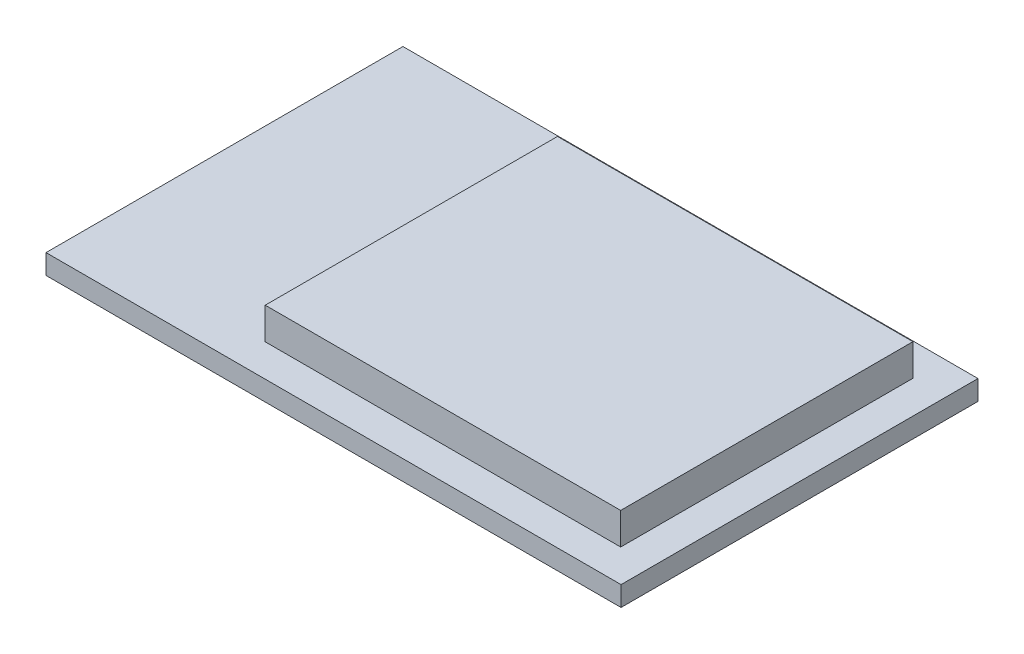
ISO-10303-21;
HEADER;
FILE_DESCRIPTION(('STEP AP214'),'2;1');
FILE_NAME('part.step','',(''),(''),'','','');
FILE_SCHEMA(('AUTOMOTIVE_DESIGN { 1 0 10303 214 1 1 1 1 }'));
ENDSEC;
DATA;
#1=APPLICATION_CONTEXT('core data for automotive mechanical design processes');
#2=APPLICATION_PROTOCOL_DEFINITION('international standard','automotive_design',2000,#1);
#3=PRODUCT_CONTEXT('',#1,'mechanical');
#4=PRODUCT('Part','Part','',(#3));
#5=PRODUCT_RELATED_PRODUCT_CATEGORY('part','',(#4));
#6=PRODUCT_DEFINITION_FORMATION('','',#4);
#7=PRODUCT_DEFINITION_CONTEXT('part definition',#1,'design');
#8=PRODUCT_DEFINITION('design','',#6,#7);
#9=PRODUCT_DEFINITION_SHAPE('','',#8);
#10=(LENGTH_UNIT() NAMED_UNIT(*) SI_UNIT(.MILLI.,.METRE.));
#11=(NAMED_UNIT(*) PLANE_ANGLE_UNIT() SI_UNIT($,.RADIAN.));
#12=(NAMED_UNIT(*) SI_UNIT($,.STERADIAN.) SOLID_ANGLE_UNIT());
#13=UNCERTAINTY_MEASURE_WITH_UNIT(LENGTH_MEASURE(1.E-05),#10,'distance_accuracy_value','');
#14=(GEOMETRIC_REPRESENTATION_CONTEXT(3) GLOBAL_UNCERTAINTY_ASSIGNED_CONTEXT((#13)) GLOBAL_UNIT_ASSIGNED_CONTEXT((#10,
#11,#12)) REPRESENTATION_CONTEXT('',''));
#15=CARTESIAN_POINT('',(0.,0.,0.));
#16=DIRECTION('',(0.,0.,1.));
#17=DIRECTION('',(1.,0.,0.));
#18=AXIS2_PLACEMENT_3D('',#15,#16,#17);
#19=CARTESIAN_POINT('',(0.,1.,0.));
#20=DIRECTION('',(0.,1.,0.));
#21=DIRECTION('',(0.,0.,1.));
#22=AXIS2_PLACEMENT_3D('',#19,#20,#21);
#23=PLANE('',#22);
#24=DIRECTION('',(0.,0.,1.));
#25=VECTOR('',#24,1.);
#26=CARTESIAN_POINT('',(-14.5,1.,-9.));
#27=LINE('',#26,#25);
#28=CARTESIAN_POINT('',(-14.5,1.,-9.));
#29=VERTEX_POINT('',#28);
#30=CARTESIAN_POINT('',(-14.5,1.,9.));
#31=VERTEX_POINT('',#30);
#32=EDGE_CURVE('E140',#29,#31,#27,.T.);
#33=ORIENTED_EDGE('',*,*,#32,.T.);
#34=DIRECTION('',(1.,0.,0.));
#35=VECTOR('',#34,1.);
#36=CARTESIAN_POINT('',(-14.5,1.,9.));
#37=LINE('',#36,#35);
#38=CARTESIAN_POINT('',(14.5,1.,9.));
#39=VERTEX_POINT('',#38);
#40=EDGE_CURVE('E85',#31,#39,#37,.T.);
#41=ORIENTED_EDGE('',*,*,#40,.T.);
#42=DIRECTION('',(0.,0.,-1.));
#43=VECTOR('',#42,1.);
#44=CARTESIAN_POINT('',(14.5,1.,-9.));
#45=LINE('',#44,#43);
#46=CARTESIAN_POINT('',(14.5,1.,-9.));
#47=VERTEX_POINT('',#46);
#48=EDGE_CURVE('E143',#39,#47,#45,.T.);
#49=ORIENTED_EDGE('',*,*,#48,.T.);
#50=DIRECTION('',(-1.,0.,0.));
#51=VECTOR('',#50,1.);
#52=CARTESIAN_POINT('',(-14.5,1.,-9.));
#53=LINE('',#52,#51);
#54=EDGE_CURVE('E57',#47,#29,#53,.T.);
#55=ORIENTED_EDGE('',*,*,#54,.T.);
#56=EDGE_LOOP('',(#33,#41,#49,#55));
#57=FACE_BOUND('',#56,.T.);
#58=DIRECTION('',(1.,0.,0.));
#59=VECTOR('',#58,1.);
#60=CARTESIAN_POINT('',(-5.075,1.,7.36915980320777));
#61=LINE('',#60,#59);
#62=CARTESIAN_POINT('',(-5.075,1.,7.36915980320777));
#63=VERTEX_POINT('',#62);
#64=CARTESIAN_POINT('',(12.85,1.,7.36915980320777));
#65=VERTEX_POINT('',#64);
#66=EDGE_CURVE('E263',#63,#65,#61,.T.);
#67=ORIENTED_EDGE('',*,*,#66,.F.);
#68=DIRECTION('',(0.,0.,1.));
#69=VECTOR('',#68,1.);
#70=CARTESIAN_POINT('',(-5.075,1.,7.36915980320777));
#71=LINE('',#70,#69);
#72=CARTESIAN_POINT('',(-5.075,1.,-7.36915980320777));
#73=VERTEX_POINT('',#72);
#74=EDGE_CURVE('E130',#73,#63,#71,.T.);
#75=ORIENTED_EDGE('',*,*,#74,.F.);
#76=DIRECTION('',(-1.,0.,0.));
#77=VECTOR('',#76,1.);
#78=CARTESIAN_POINT('',(-5.075,1.,-7.36915980320777));
#79=LINE('',#78,#77);
#80=CARTESIAN_POINT('',(12.85,1.,-7.36915980320777));
#81=VERTEX_POINT('',#80);
#82=EDGE_CURVE('E126',#81,#73,#79,.T.);
#83=ORIENTED_EDGE('',*,*,#82,.F.);
#84=DIRECTION('',(0.,0.,-1.));
#85=VECTOR('',#84,1.);
#86=CARTESIAN_POINT('',(12.85,1.,7.36915980320777));
#87=LINE('',#86,#85);
#88=EDGE_CURVE('E260',#65,#81,#87,.T.);
#89=ORIENTED_EDGE('',*,*,#88,.F.);
#90=EDGE_LOOP('',(#67,#75,#83,#89));
#91=FACE_BOUND('',#90,.T.);
#92=ADVANCED_FACE('F33',(#57,#91),#23,.T.);
#93=CARTESIAN_POINT('',(-14.5,1.,-9.));
#94=DIRECTION('',(1.,0.,0.));
#95=DIRECTION('',(0.,0.,-1.));
#96=AXIS2_PLACEMENT_3D('',#93,#94,#95);
#97=PLANE('',#96);
#98=DIRECTION('',(0.,0.,1.));
#99=VECTOR('',#98,1.);
#100=CARTESIAN_POINT('',(-14.5,0.,-9.));
#101=LINE('',#100,#99);
#102=CARTESIAN_POINT('',(-14.5,0.,-9.));
#103=VERTEX_POINT('',#102);
#104=CARTESIAN_POINT('',(-14.5,0.,9.));
#105=VERTEX_POINT('',#104);
#106=EDGE_CURVE('E132',#103,#105,#101,.T.);
#107=ORIENTED_EDGE('',*,*,#106,.T.);
#108=DIRECTION('',(0.,-1.,0.));
#109=VECTOR('',#108,1.);
#110=CARTESIAN_POINT('',(-14.5,1.,9.));
#111=LINE('',#110,#109);
#112=EDGE_CURVE('E11',#31,#105,#111,.T.);
#113=ORIENTED_EDGE('',*,*,#112,.F.);
#114=ORIENTED_EDGE('',*,*,#32,.F.);
#115=DIRECTION('',(0.,-1.,0.));
#116=VECTOR('',#115,1.);
#117=CARTESIAN_POINT('',(-14.5,1.,-9.));
#118=LINE('',#117,#116);
#119=EDGE_CURVE('E145',#29,#103,#118,.T.);
#120=ORIENTED_EDGE('',*,*,#119,.T.);
#121=EDGE_LOOP('',(#107,#113,#114,#120));
#122=FACE_BOUND('',#121,.T.);
#123=ADVANCED_FACE('F35',(#122),#97,.F.);
#124=CARTESIAN_POINT('',(-14.5,1.,9.));
#125=DIRECTION('',(0.,0.,-1.));
#126=DIRECTION('',(-1.,0.,0.));
#127=AXIS2_PLACEMENT_3D('',#124,#125,#126);
#128=PLANE('',#127);
#129=DIRECTION('',(1.,0.,0.));
#130=VECTOR('',#129,1.);
#131=CARTESIAN_POINT('',(-14.5,0.,9.));
#132=LINE('',#131,#130);
#133=CARTESIAN_POINT('',(14.5,0.,9.));
#134=VERTEX_POINT('',#133);
#135=EDGE_CURVE('E135',#105,#134,#132,.T.);
#136=ORIENTED_EDGE('',*,*,#135,.T.);
#137=DIRECTION('',(0.,-1.,0.));
#138=VECTOR('',#137,1.);
#139=CARTESIAN_POINT('',(14.5,1.,9.));
#140=LINE('',#139,#138);
#141=EDGE_CURVE('E41',#39,#134,#140,.T.);
#142=ORIENTED_EDGE('',*,*,#141,.F.);
#143=ORIENTED_EDGE('',*,*,#40,.F.);
#144=ORIENTED_EDGE('',*,*,#112,.T.);
#145=EDGE_LOOP('',(#136,#142,#143,#144));
#146=FACE_BOUND('',#145,.T.);
#147=ADVANCED_FACE('F173',(#146),#128,.F.);
#148=CARTESIAN_POINT('',(14.5,1.,-9.));
#149=DIRECTION('',(-1.,0.,0.));
#150=DIRECTION('',(0.,0.,1.));
#151=AXIS2_PLACEMENT_3D('',#148,#149,#150);
#152=PLANE('',#151);
#153=DIRECTION('',(0.,0.,-1.));
#154=VECTOR('',#153,1.);
#155=CARTESIAN_POINT('',(14.5,0.,-9.));
#156=LINE('',#155,#154);
#157=CARTESIAN_POINT('',(14.5,0.,-9.));
#158=VERTEX_POINT('',#157);
#159=EDGE_CURVE('E148',#134,#158,#156,.T.);
#160=ORIENTED_EDGE('',*,*,#159,.T.);
#161=DIRECTION('',(0.,-1.,0.));
#162=VECTOR('',#161,1.);
#163=CARTESIAN_POINT('',(14.5,1.,-9.));
#164=LINE('',#163,#162);
#165=EDGE_CURVE('E152',#47,#158,#164,.T.);
#166=ORIENTED_EDGE('',*,*,#165,.F.);
#167=ORIENTED_EDGE('',*,*,#48,.F.);
#168=ORIENTED_EDGE('',*,*,#141,.T.);
#169=EDGE_LOOP('',(#160,#166,#167,#168));
#170=FACE_BOUND('',#169,.T.);
#171=ADVANCED_FACE('F157',(#170),#152,.F.);
#172=CARTESIAN_POINT('',(-14.5,1.,-9.));
#173=DIRECTION('',(0.,0.,1.));
#174=DIRECTION('',(1.,0.,0.));
#175=AXIS2_PLACEMENT_3D('',#172,#173,#174);
#176=PLANE('',#175);
#177=DIRECTION('',(-1.,0.,0.));
#178=VECTOR('',#177,1.);
#179=CARTESIAN_POINT('',(-14.5,0.,-9.));
#180=LINE('',#179,#178);
#181=EDGE_CURVE('E78',#158,#103,#180,.T.);
#182=ORIENTED_EDGE('',*,*,#181,.T.);
#183=ORIENTED_EDGE('',*,*,#119,.F.);
#184=ORIENTED_EDGE('',*,*,#54,.F.);
#185=ORIENTED_EDGE('',*,*,#165,.T.);
#186=EDGE_LOOP('',(#182,#183,#184,#185));
#187=FACE_BOUND('',#186,.T.);
#188=ADVANCED_FACE('F165',(#187),#176,.F.);
#189=CARTESIAN_POINT('',(0.,0.,0.));
#190=DIRECTION('',(0.,1.,0.));
#191=DIRECTION('',(0.,0.,1.));
#192=AXIS2_PLACEMENT_3D('',#189,#190,#191);
#193=PLANE('',#192);
#194=ORIENTED_EDGE('',*,*,#106,.F.);
#195=ORIENTED_EDGE('',*,*,#181,.F.);
#196=ORIENTED_EDGE('',*,*,#159,.F.);
#197=ORIENTED_EDGE('',*,*,#135,.F.);
#198=EDGE_LOOP('',(#194,#195,#196,#197));
#199=FACE_BOUND('',#198,.T.);
#200=ADVANCED_FACE('F161',(#199),#193,.F.);
#201=CARTESIAN_POINT('',(-5.075,2.6,7.36915980320777));
#202=DIRECTION('',(1.,0.,0.));
#203=DIRECTION('',(0.,0.,-1.));
#204=AXIS2_PLACEMENT_3D('',#201,#202,#203);
#205=PLANE('',#204);
#206=ORIENTED_EDGE('',*,*,#74,.T.);
#207=DIRECTION('',(0.,-1.,0.));
#208=VECTOR('',#207,1.);
#209=CARTESIAN_POINT('',(-5.075,2.6,7.36915980320777));
#210=LINE('',#209,#208);
#211=CARTESIAN_POINT('',(-5.075,2.6,7.36915980320777));
#212=VERTEX_POINT('',#211);
#213=EDGE_CURVE('E111',#212,#63,#210,.T.);
#214=ORIENTED_EDGE('',*,*,#213,.F.);
#215=DIRECTION('',(0.,0.,1.));
#216=VECTOR('',#215,1.);
#217=CARTESIAN_POINT('',(-5.075,2.6,7.36915980320777));
#218=LINE('',#217,#216);
#219=CARTESIAN_POINT('',(-5.075,2.6,-7.36915980320777));
#220=VERTEX_POINT('',#219);
#221=EDGE_CURVE('E118',#220,#212,#218,.T.);
#222=ORIENTED_EDGE('',*,*,#221,.F.);
#223=DIRECTION('',(0.,-1.,0.));
#224=VECTOR('',#223,1.);
#225=CARTESIAN_POINT('',(-5.075,2.6,-7.36915980320777));
#226=LINE('',#225,#224);
#227=EDGE_CURVE('E258',#220,#73,#226,.T.);
#228=ORIENTED_EDGE('',*,*,#227,.T.);
#229=EDGE_LOOP('',(#206,#214,#222,#228));
#230=FACE_BOUND('',#229,.T.);
#231=ADVANCED_FACE('F128',(#230),#205,.F.);
#232=CARTESIAN_POINT('',(-5.075,2.6,7.36915980320777));
#233=DIRECTION('',(0.,0.,-1.));
#234=DIRECTION('',(-1.,0.,0.));
#235=AXIS2_PLACEMENT_3D('',#232,#233,#234);
#236=PLANE('',#235);
#237=ORIENTED_EDGE('',*,*,#66,.T.);
#238=DIRECTION('',(0.,-1.,0.));
#239=VECTOR('',#238,1.);
#240=CARTESIAN_POINT('',(12.85,2.6,7.36915980320777));
#241=LINE('',#240,#239);
#242=CARTESIAN_POINT('',(12.85,2.6,7.36915980320777));
#243=VERTEX_POINT('',#242);
#244=EDGE_CURVE('E114',#243,#65,#241,.T.);
#245=ORIENTED_EDGE('',*,*,#244,.F.);
#246=DIRECTION('',(1.,0.,0.));
#247=VECTOR('',#246,1.);
#248=CARTESIAN_POINT('',(-5.075,2.6,7.36915980320777));
#249=LINE('',#248,#247);
#250=EDGE_CURVE('E107',#212,#243,#249,.T.);
#251=ORIENTED_EDGE('',*,*,#250,.F.);
#252=ORIENTED_EDGE('',*,*,#213,.T.);
#253=EDGE_LOOP('',(#237,#245,#251,#252));
#254=FACE_BOUND('',#253,.T.);
#255=ADVANCED_FACE('F109',(#254),#236,.F.);
#256=CARTESIAN_POINT('',(12.85,2.6,7.36915980320777));
#257=DIRECTION('',(-1.,0.,0.));
#258=DIRECTION('',(0.,0.,1.));
#259=AXIS2_PLACEMENT_3D('',#256,#257,#258);
#260=PLANE('',#259);
#261=ORIENTED_EDGE('',*,*,#88,.T.);
#262=DIRECTION('',(0.,-1.,0.));
#263=VECTOR('',#262,1.);
#264=CARTESIAN_POINT('',(12.85,2.6,-7.36915980320777));
#265=LINE('',#264,#263);
#266=CARTESIAN_POINT('',(12.85,2.6,-7.36915980320777));
#267=VERTEX_POINT('',#266);
#268=EDGE_CURVE('E48',#267,#81,#265,.T.);
#269=ORIENTED_EDGE('',*,*,#268,.F.);
#270=DIRECTION('',(0.,0.,-1.));
#271=VECTOR('',#270,1.);
#272=CARTESIAN_POINT('',(12.85,2.6,7.36915980320777));
#273=LINE('',#272,#271);
#274=EDGE_CURVE('E117',#243,#267,#273,.T.);
#275=ORIENTED_EDGE('',*,*,#274,.F.);
#276=ORIENTED_EDGE('',*,*,#244,.T.);
#277=EDGE_LOOP('',(#261,#269,#275,#276));
#278=FACE_BOUND('',#277,.T.);
#279=ADVANCED_FACE('F188',(#278),#260,.F.);
#280=CARTESIAN_POINT('',(-5.075,2.6,-7.36915980320777));
#281=DIRECTION('',(0.,0.,1.));
#282=DIRECTION('',(1.,0.,0.));
#283=AXIS2_PLACEMENT_3D('',#280,#281,#282);
#284=PLANE('',#283);
#285=ORIENTED_EDGE('',*,*,#82,.T.);
#286=ORIENTED_EDGE('',*,*,#227,.F.);
#287=DIRECTION('',(-1.,0.,0.));
#288=VECTOR('',#287,1.);
#289=CARTESIAN_POINT('',(-5.075,2.6,-7.36915980320777));
#290=LINE('',#289,#288);
#291=EDGE_CURVE('E122',#267,#220,#290,.T.);
#292=ORIENTED_EDGE('',*,*,#291,.F.);
#293=ORIENTED_EDGE('',*,*,#268,.T.);
#294=EDGE_LOOP('',(#285,#286,#292,#293));
#295=FACE_BOUND('',#294,.T.);
#296=ADVANCED_FACE('F191',(#295),#284,.F.);
#297=CARTESIAN_POINT('',(0.,2.6,0.));
#298=DIRECTION('',(0.,-1.,0.));
#299=DIRECTION('',(0.,0.,-1.));
#300=AXIS2_PLACEMENT_3D('',#297,#298,#299);
#301=PLANE('',#300);
#302=ORIENTED_EDGE('',*,*,#221,.T.);
#303=ORIENTED_EDGE('',*,*,#250,.T.);
#304=ORIENTED_EDGE('',*,*,#274,.T.);
#305=ORIENTED_EDGE('',*,*,#291,.T.);
#306=EDGE_LOOP('',(#302,#303,#304,#305));
#307=FACE_BOUND('',#306,.T.);
#308=ADVANCED_FACE('F121',(#307),#301,.F.);
#309=CLOSED_SHELL('',(#92,#123,#147,#171,#188,#200,#231,#255,#279,#296,#308));
#310=MANIFOLD_SOLID_BREP('B2',#309);
#311=ADVANCED_BREP_SHAPE_REPRESENTATION('',(#18,#310),#14);
#312=SHAPE_DEFINITION_REPRESENTATION(#9,#311);
ENDSEC;
END-ISO-10303-21;
